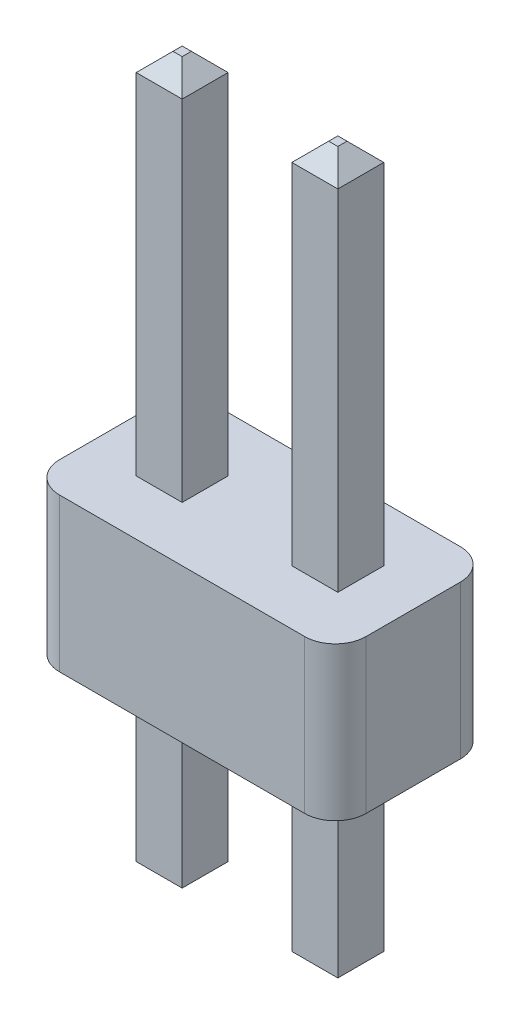
ISO-10303-21;
HEADER;
FILE_DESCRIPTION(('STEP AP214'),'2;1');
FILE_NAME('part.step','',(''),(''),'','','');
FILE_SCHEMA(('AUTOMOTIVE_DESIGN { 1 0 10303 214 1 1 1 1 }'));
ENDSEC;
DATA;
#1=APPLICATION_CONTEXT('core data for automotive mechanical design processes');
#2=APPLICATION_PROTOCOL_DEFINITION('international standard','automotive_design',2000,#1);
#3=PRODUCT_CONTEXT('',#1,'mechanical');
#4=PRODUCT('Part','Part','',(#3));
#5=PRODUCT_RELATED_PRODUCT_CATEGORY('part','',(#4));
#6=PRODUCT_DEFINITION_FORMATION('','',#4);
#7=PRODUCT_DEFINITION_CONTEXT('part definition',#1,'design');
#8=PRODUCT_DEFINITION('design','',#6,#7);
#9=PRODUCT_DEFINITION_SHAPE('','',#8);
#10=(LENGTH_UNIT() NAMED_UNIT(*) SI_UNIT(.MILLI.,.METRE.));
#11=(NAMED_UNIT(*) PLANE_ANGLE_UNIT() SI_UNIT($,.RADIAN.));
#12=(NAMED_UNIT(*) SI_UNIT($,.STERADIAN.) SOLID_ANGLE_UNIT());
#13=UNCERTAINTY_MEASURE_WITH_UNIT(LENGTH_MEASURE(1.E-05),#10,'distance_accuracy_value','');
#14=(GEOMETRIC_REPRESENTATION_CONTEXT(3) GLOBAL_UNCERTAINTY_ASSIGNED_CONTEXT((#13)) GLOBAL_UNIT_ASSIGNED_CONTEXT((#10,
#11,#12)) REPRESENTATION_CONTEXT('',''));
#15=CARTESIAN_POINT('',(0.,0.,0.));
#16=DIRECTION('',(0.,0.,1.));
#17=DIRECTION('',(1.,0.,0.));
#18=AXIS2_PLACEMENT_3D('',#15,#16,#17);
#19=CARTESIAN_POINT('',(2.,2.5,0.77));
#20=DIRECTION('',(0.,-1.,0.));
#21=DIRECTION('',(0.,0.,-1.));
#22=AXIS2_PLACEMENT_3D('',#19,#20,#21);
#23=CYLINDRICAL_SURFACE('',#22,0.5);
#24=CARTESIAN_POINT('',(2.,0.,0.77));
#25=DIRECTION('',(0.,1.,0.));
#26=DIRECTION('',(0.,0.,1.));
#27=AXIS2_PLACEMENT_3D('',#24,#25,#26);
#28=CIRCLE('',#27,0.5);
#29=CARTESIAN_POINT('',(2.,0.,1.27));
#30=VERTEX_POINT('',#29);
#31=CARTESIAN_POINT('',(2.5,0.,0.77));
#32=VERTEX_POINT('',#31);
#33=EDGE_CURVE('E389',#30,#32,#28,.T.);
#34=ORIENTED_EDGE('',*,*,#33,.T.);
#35=DIRECTION('',(0.,-1.,0.));
#36=VECTOR('',#35,1.);
#37=CARTESIAN_POINT('',(2.5,2.5,0.77));
#38=LINE('',#37,#36);
#39=CARTESIAN_POINT('',(2.5,2.5,0.77));
#40=VERTEX_POINT('',#39);
#41=EDGE_CURVE('E466',#40,#32,#38,.T.);
#42=ORIENTED_EDGE('',*,*,#41,.F.);
#43=CARTESIAN_POINT('',(2.,2.5,0.77));
#44=DIRECTION('',(0.,1.,0.));
#45=DIRECTION('',(0.,0.,1.));
#46=AXIS2_PLACEMENT_3D('',#43,#44,#45);
#47=CIRCLE('',#46,0.5);
#48=CARTESIAN_POINT('',(2.,2.5,1.27));
#49=VERTEX_POINT('',#48);
#50=EDGE_CURVE('E390',#49,#40,#47,.T.);
#51=ORIENTED_EDGE('',*,*,#50,.F.);
#52=DIRECTION('',(0.,-1.,0.));
#53=VECTOR('',#52,1.);
#54=CARTESIAN_POINT('',(2.,2.5,1.27));
#55=LINE('',#54,#53);
#56=EDGE_CURVE('E415',#49,#30,#55,.T.);
#57=ORIENTED_EDGE('',*,*,#56,.T.);
#58=EDGE_LOOP('',(#34,#42,#51,#57));
#59=FACE_BOUND('',#58,.T.);
#60=ADVANCED_FACE('F42',(#59),#23,.T.);
#61=CARTESIAN_POINT('',(2.5,2.5,-0.77));
#62=DIRECTION('',(-1.,0.,0.));
#63=DIRECTION('',(0.,0.,1.));
#64=AXIS2_PLACEMENT_3D('',#61,#62,#63);
#65=PLANE('',#64);
#66=DIRECTION('',(0.,0.,-1.));
#67=VECTOR('',#66,1.);
#68=CARTESIAN_POINT('',(2.5,0.,-0.77));
#69=LINE('',#68,#67);
#70=CARTESIAN_POINT('',(2.5,0.,-0.77));
#71=VERTEX_POINT('',#70);
#72=EDGE_CURVE('E419',#32,#71,#69,.T.);
#73=ORIENTED_EDGE('',*,*,#72,.T.);
#74=DIRECTION('',(0.,-1.,0.));
#75=VECTOR('',#74,1.);
#76=CARTESIAN_POINT('',(2.5,2.5,-0.77));
#77=LINE('',#76,#75);
#78=CARTESIAN_POINT('',(2.5,2.5,-0.77));
#79=VERTEX_POINT('',#78);
#80=EDGE_CURVE('E462',#79,#71,#77,.T.);
#81=ORIENTED_EDGE('',*,*,#80,.F.);
#82=DIRECTION('',(0.,0.,-1.));
#83=VECTOR('',#82,1.);
#84=CARTESIAN_POINT('',(2.5,2.5,-0.77));
#85=LINE('',#84,#83);
#86=EDGE_CURVE('E394',#40,#79,#85,.T.);
#87=ORIENTED_EDGE('',*,*,#86,.F.);
#88=ORIENTED_EDGE('',*,*,#41,.T.);
#89=EDGE_LOOP('',(#73,#81,#87,#88));
#90=FACE_BOUND('',#89,.T.);
#91=ADVANCED_FACE('F689',(#90),#65,.F.);
#92=CARTESIAN_POINT('',(2.,2.5,-0.77));
#93=DIRECTION('',(0.,-1.,0.));
#94=DIRECTION('',(0.,0.,-1.));
#95=AXIS2_PLACEMENT_3D('',#92,#93,#94);
#96=CYLINDRICAL_SURFACE('',#95,0.5);
#97=CARTESIAN_POINT('',(2.,0.,-0.77));
#98=DIRECTION('',(0.,1.,0.));
#99=DIRECTION('',(0.,0.,1.));
#100=AXIS2_PLACEMENT_3D('',#97,#98,#99);
#101=CIRCLE('',#100,0.5);
#102=CARTESIAN_POINT('',(2.,0.,-1.27));
#103=VERTEX_POINT('',#102);
#104=EDGE_CURVE('E422',#71,#103,#101,.T.);
#105=ORIENTED_EDGE('',*,*,#104,.T.);
#106=DIRECTION('',(0.,-1.,0.));
#107=VECTOR('',#106,1.);
#108=CARTESIAN_POINT('',(2.,2.5,-1.27));
#109=LINE('',#108,#107);
#110=CARTESIAN_POINT('',(2.,2.5,-1.27));
#111=VERTEX_POINT('',#110);
#112=EDGE_CURVE('E458',#111,#103,#109,.T.);
#113=ORIENTED_EDGE('',*,*,#112,.F.);
#114=CARTESIAN_POINT('',(2.,2.5,-0.77));
#115=DIRECTION('',(0.,1.,0.));
#116=DIRECTION('',(0.,0.,1.));
#117=AXIS2_PLACEMENT_3D('',#114,#115,#116);
#118=CIRCLE('',#117,0.5);
#119=EDGE_CURVE('E397',#79,#111,#118,.T.);
#120=ORIENTED_EDGE('',*,*,#119,.F.);
#121=ORIENTED_EDGE('',*,*,#80,.T.);
#122=EDGE_LOOP('',(#105,#113,#120,#121));
#123=FACE_BOUND('',#122,.T.);
#124=ADVANCED_FACE('F695',(#123),#96,.T.);
#125=CARTESIAN_POINT('',(-2.,2.5,-1.27));
#126=DIRECTION('',(0.,0.,1.));
#127=DIRECTION('',(1.,0.,0.));
#128=AXIS2_PLACEMENT_3D('',#125,#126,#127);
#129=PLANE('',#128);
#130=DIRECTION('',(-1.,0.,0.));
#131=VECTOR('',#130,1.);
#132=CARTESIAN_POINT('',(-2.,0.,-1.27));
#133=LINE('',#132,#131);
#134=CARTESIAN_POINT('',(-2.,0.,-1.27));
#135=VERTEX_POINT('',#134);
#136=EDGE_CURVE('E425',#103,#135,#133,.T.);
#137=ORIENTED_EDGE('',*,*,#136,.T.);
#138=DIRECTION('',(0.,-1.,0.));
#139=VECTOR('',#138,1.);
#140=CARTESIAN_POINT('',(-2.,2.5,-1.27));
#141=LINE('',#140,#139);
#142=CARTESIAN_POINT('',(-2.,2.5,-1.27));
#143=VERTEX_POINT('',#142);
#144=EDGE_CURVE('E454',#143,#135,#141,.T.);
#145=ORIENTED_EDGE('',*,*,#144,.F.);
#146=DIRECTION('',(-1.,0.,0.));
#147=VECTOR('',#146,1.);
#148=CARTESIAN_POINT('',(-2.,2.5,-1.27));
#149=LINE('',#148,#147);
#150=EDGE_CURVE('E400',#111,#143,#149,.T.);
#151=ORIENTED_EDGE('',*,*,#150,.F.);
#152=ORIENTED_EDGE('',*,*,#112,.T.);
#153=EDGE_LOOP('',(#137,#145,#151,#152));
#154=FACE_BOUND('',#153,.T.);
#155=ADVANCED_FACE('F1042',(#154),#129,.F.);
#156=CARTESIAN_POINT('',(-2.,2.5,-0.77));
#157=DIRECTION('',(0.,-1.,0.));
#158=DIRECTION('',(0.,0.,-1.));
#159=AXIS2_PLACEMENT_3D('',#156,#157,#158);
#160=CYLINDRICAL_SURFACE('',#159,0.5);
#161=CARTESIAN_POINT('',(-2.,0.,-0.77));
#162=DIRECTION('',(0.,1.,0.));
#163=DIRECTION('',(0.,0.,1.));
#164=AXIS2_PLACEMENT_3D('',#161,#162,#163);
#165=CIRCLE('',#164,0.5);
#166=CARTESIAN_POINT('',(-2.5,0.,-0.77));
#167=VERTEX_POINT('',#166);
#168=EDGE_CURVE('E428',#135,#167,#165,.T.);
#169=ORIENTED_EDGE('',*,*,#168,.T.);
#170=DIRECTION('',(0.,-1.,0.));
#171=VECTOR('',#170,1.);
#172=CARTESIAN_POINT('',(-2.5,2.5,-0.77));
#173=LINE('',#172,#171);
#174=CARTESIAN_POINT('',(-2.5,2.5,-0.77));
#175=VERTEX_POINT('',#174);
#176=EDGE_CURVE('E450',#175,#167,#173,.T.);
#177=ORIENTED_EDGE('',*,*,#176,.F.);
#178=CARTESIAN_POINT('',(-2.,2.5,-0.77));
#179=DIRECTION('',(0.,1.,0.));
#180=DIRECTION('',(0.,0.,1.));
#181=AXIS2_PLACEMENT_3D('',#178,#179,#180);
#182=CIRCLE('',#181,0.5);
#183=EDGE_CURVE('E403',#143,#175,#182,.T.);
#184=ORIENTED_EDGE('',*,*,#183,.F.);
#185=ORIENTED_EDGE('',*,*,#144,.T.);
#186=EDGE_LOOP('',(#169,#177,#184,#185));
#187=FACE_BOUND('',#186,.T.);
#188=ADVANCED_FACE('F1030',(#187),#160,.T.);
#189=CARTESIAN_POINT('',(-2.5,2.5,0.77));
#190=DIRECTION('',(1.,0.,0.));
#191=DIRECTION('',(0.,0.,-1.));
#192=AXIS2_PLACEMENT_3D('',#189,#190,#191);
#193=PLANE('',#192);
#194=DIRECTION('',(0.,0.,1.));
#195=VECTOR('',#194,1.);
#196=CARTESIAN_POINT('',(-2.5,0.,0.77));
#197=LINE('',#196,#195);
#198=CARTESIAN_POINT('',(-2.5,0.,0.77));
#199=VERTEX_POINT('',#198);
#200=EDGE_CURVE('E431',#167,#199,#197,.T.);
#201=ORIENTED_EDGE('',*,*,#200,.T.);
#202=DIRECTION('',(0.,-1.,0.));
#203=VECTOR('',#202,1.);
#204=CARTESIAN_POINT('',(-2.5,2.5,0.77));
#205=LINE('',#204,#203);
#206=CARTESIAN_POINT('',(-2.5,2.5,0.77));
#207=VERTEX_POINT('',#206);
#208=EDGE_CURVE('E446',#207,#199,#205,.T.);
#209=ORIENTED_EDGE('',*,*,#208,.F.);
#210=DIRECTION('',(0.,0.,1.));
#211=VECTOR('',#210,1.);
#212=CARTESIAN_POINT('',(-2.5,2.5,0.77));
#213=LINE('',#212,#211);
#214=EDGE_CURVE('E406',#175,#207,#213,.T.);
#215=ORIENTED_EDGE('',*,*,#214,.F.);
#216=ORIENTED_EDGE('',*,*,#176,.T.);
#217=EDGE_LOOP('',(#201,#209,#215,#216));
#218=FACE_BOUND('',#217,.T.);
#219=ADVANCED_FACE('F1019',(#218),#193,.F.);
#220=CARTESIAN_POINT('',(-2.,2.5,0.77));
#221=DIRECTION('',(0.,-1.,0.));
#222=DIRECTION('',(0.,0.,-1.));
#223=AXIS2_PLACEMENT_3D('',#220,#221,#222);
#224=CYLINDRICAL_SURFACE('',#223,0.5);
#225=CARTESIAN_POINT('',(-2.,0.,0.77));
#226=DIRECTION('',(0.,1.,0.));
#227=DIRECTION('',(0.,0.,1.));
#228=AXIS2_PLACEMENT_3D('',#225,#226,#227);
#229=CIRCLE('',#228,0.5);
#230=CARTESIAN_POINT('',(-2.,0.,1.27));
#231=VERTEX_POINT('',#230);
#232=EDGE_CURVE('E434',#199,#231,#229,.T.);
#233=ORIENTED_EDGE('',*,*,#232,.T.);
#234=DIRECTION('',(0.,-1.,0.));
#235=VECTOR('',#234,1.);
#236=CARTESIAN_POINT('',(-2.,2.5,1.27));
#237=LINE('',#236,#235);
#238=CARTESIAN_POINT('',(-2.,2.5,1.27));
#239=VERTEX_POINT('',#238);
#240=EDGE_CURVE('E442',#239,#231,#237,.T.);
#241=ORIENTED_EDGE('',*,*,#240,.F.);
#242=CARTESIAN_POINT('',(-2.,2.5,0.77));
#243=DIRECTION('',(0.,1.,0.));
#244=DIRECTION('',(0.,0.,1.));
#245=AXIS2_PLACEMENT_3D('',#242,#243,#244);
#246=CIRCLE('',#245,0.5);
#247=EDGE_CURVE('E409',#207,#239,#246,.T.);
#248=ORIENTED_EDGE('',*,*,#247,.F.);
#249=ORIENTED_EDGE('',*,*,#208,.T.);
#250=EDGE_LOOP('',(#233,#241,#248,#249));
#251=FACE_BOUND('',#250,.T.);
#252=ADVANCED_FACE('F1007',(#251),#224,.T.);
#253=CARTESIAN_POINT('',(2.,2.5,1.27));
#254=DIRECTION('',(0.,0.,-1.));
#255=DIRECTION('',(-1.,0.,0.));
#256=AXIS2_PLACEMENT_3D('',#253,#254,#255);
#257=PLANE('',#256);
#258=DIRECTION('',(1.,0.,0.));
#259=VECTOR('',#258,1.);
#260=CARTESIAN_POINT('',(2.,0.,1.27));
#261=LINE('',#260,#259);
#262=EDGE_CURVE('E395',#231,#30,#261,.T.);
#263=ORIENTED_EDGE('',*,*,#262,.T.);
#264=ORIENTED_EDGE('',*,*,#56,.F.);
#265=DIRECTION('',(1.,0.,0.));
#266=VECTOR('',#265,1.);
#267=CARTESIAN_POINT('',(2.,2.5,1.27));
#268=LINE('',#267,#266);
#269=EDGE_CURVE('E412',#239,#49,#268,.T.);
#270=ORIENTED_EDGE('',*,*,#269,.F.);
#271=ORIENTED_EDGE('',*,*,#240,.T.);
#272=EDGE_LOOP('',(#263,#264,#270,#271));
#273=FACE_BOUND('',#272,.T.);
#274=ADVANCED_FACE('F997',(#273),#257,.F.);
#275=CARTESIAN_POINT('',(2.,2.5,0.77));
#276=DIRECTION('',(0.,1.,0.));
#277=DIRECTION('',(0.,0.,1.));
#278=AXIS2_PLACEMENT_3D('',#275,#276,#277);
#279=PLANE('',#278);
#280=DIRECTION('',(0.,0.,1.));
#281=VECTOR('',#280,1.);
#282=CARTESIAN_POINT('',(0.895,2.5,0.77));
#283=LINE('',#282,#281);
#284=CARTESIAN_POINT('',(0.895,2.5,-0.375));
#285=VERTEX_POINT('',#284);
#286=CARTESIAN_POINT('',(0.895,2.5,0.375));
#287=VERTEX_POINT('',#286);
#288=EDGE_CURVE('E354',#285,#287,#283,.T.);
#289=ORIENTED_EDGE('',*,*,#288,.F.);
#290=DIRECTION('',(-1.,0.,0.));
#291=VECTOR('',#290,1.);
#292=CARTESIAN_POINT('',(2.,2.5,-0.375));
#293=LINE('',#292,#291);
#294=CARTESIAN_POINT('',(1.645,2.5,-0.375));
#295=VERTEX_POINT('',#294);
#296=EDGE_CURVE('E325',#295,#285,#293,.T.);
#297=ORIENTED_EDGE('',*,*,#296,.F.);
#298=DIRECTION('',(0.,0.,-1.));
#299=VECTOR('',#298,1.);
#300=CARTESIAN_POINT('',(1.645,2.5,0.77));
#301=LINE('',#300,#299);
#302=CARTESIAN_POINT('',(1.645,2.5,0.375));
#303=VERTEX_POINT('',#302);
#304=EDGE_CURVE('E318',#303,#295,#301,.T.);
#305=ORIENTED_EDGE('',*,*,#304,.F.);
#306=DIRECTION('',(1.,0.,0.));
#307=VECTOR('',#306,1.);
#308=CARTESIAN_POINT('',(2.,2.5,0.375));
#309=LINE('',#308,#307);
#310=EDGE_CURVE('E322',#287,#303,#309,.T.);
#311=ORIENTED_EDGE('',*,*,#310,.F.);
#312=EDGE_LOOP('',(#289,#297,#305,#311));
#313=FACE_BOUND('',#312,.T.);
#314=DIRECTION('',(0.,0.,-1.));
#315=VECTOR('',#314,1.);
#316=CARTESIAN_POINT('',(-0.895,2.5,0.77));
#317=LINE('',#316,#315);
#318=CARTESIAN_POINT('',(-0.895,2.5,0.375));
#319=VERTEX_POINT('',#318);
#320=CARTESIAN_POINT('',(-0.895,2.5,-0.375));
#321=VERTEX_POINT('',#320);
#322=EDGE_CURVE('E385',#319,#321,#317,.T.);
#323=ORIENTED_EDGE('',*,*,#322,.F.);
#324=DIRECTION('',(1.,0.,0.));
#325=VECTOR('',#324,1.);
#326=CARTESIAN_POINT('',(2.,2.5,0.375));
#327=LINE('',#326,#325);
#328=CARTESIAN_POINT('',(-1.645,2.5,0.375));
#329=VERTEX_POINT('',#328);
#330=EDGE_CURVE('E381',#329,#319,#327,.T.);
#331=ORIENTED_EDGE('',*,*,#330,.F.);
#332=DIRECTION('',(0.,0.,1.));
#333=VECTOR('',#332,1.);
#334=CARTESIAN_POINT('',(-1.645,2.5,0.77));
#335=LINE('',#334,#333);
#336=CARTESIAN_POINT('',(-1.645,2.5,-0.375));
#337=VERTEX_POINT('',#336);
#338=EDGE_CURVE('E377',#337,#329,#335,.T.);
#339=ORIENTED_EDGE('',*,*,#338,.F.);
#340=DIRECTION('',(-1.,0.,0.));
#341=VECTOR('',#340,1.);
#342=CARTESIAN_POINT('',(2.,2.5,-0.375));
#343=LINE('',#342,#341);
#344=EDGE_CURVE('E361',#321,#337,#343,.T.);
#345=ORIENTED_EDGE('',*,*,#344,.F.);
#346=EDGE_LOOP('',(#323,#331,#339,#345));
#347=FACE_BOUND('',#346,.T.);
#348=ORIENTED_EDGE('',*,*,#50,.T.);
#349=ORIENTED_EDGE('',*,*,#86,.T.);
#350=ORIENTED_EDGE('',*,*,#119,.T.);
#351=ORIENTED_EDGE('',*,*,#150,.T.);
#352=ORIENTED_EDGE('',*,*,#183,.T.);
#353=ORIENTED_EDGE('',*,*,#214,.T.);
#354=ORIENTED_EDGE('',*,*,#247,.T.);
#355=ORIENTED_EDGE('',*,*,#269,.T.);
#356=EDGE_LOOP('',(#348,#349,#350,#351,#352,#353,#354,#355));
#357=FACE_BOUND('',#356,.T.);
#358=ADVANCED_FACE('F320',(#313,#347,#357),#279,.T.);
#359=CARTESIAN_POINT('',(2.,0.,0.77));
#360=DIRECTION('',(0.,1.,0.));
#361=DIRECTION('',(0.,0.,1.));
#362=AXIS2_PLACEMENT_3D('',#359,#360,#361);
#363=PLANE('',#362);
#364=DIRECTION('',(-1.,0.,0.));
#365=VECTOR('',#364,1.);
#366=CARTESIAN_POINT('',(2.,0.,-0.375));
#367=LINE('',#366,#365);
#368=CARTESIAN_POINT('',(1.645,0.,-0.375));
#369=VERTEX_POINT('',#368);
#370=CARTESIAN_POINT('',(0.895,0.,-0.375));
#371=VERTEX_POINT('',#370);
#372=EDGE_CURVE('E494',#369,#371,#367,.T.);
#373=ORIENTED_EDGE('',*,*,#372,.T.);
#374=DIRECTION('',(0.,0.,1.));
#375=VECTOR('',#374,1.);
#376=CARTESIAN_POINT('',(0.895,0.,0.77));
#377=LINE('',#376,#375);
#378=CARTESIAN_POINT('',(0.895,0.,0.375));
#379=VERTEX_POINT('',#378);
#380=EDGE_CURVE('E498',#371,#379,#377,.T.);
#381=ORIENTED_EDGE('',*,*,#380,.T.);
#382=DIRECTION('',(1.,0.,0.));
#383=VECTOR('',#382,1.);
#384=CARTESIAN_POINT('',(2.,0.,0.375));
#385=LINE('',#384,#383);
#386=CARTESIAN_POINT('',(1.645,0.,0.375));
#387=VERTEX_POINT('',#386);
#388=EDGE_CURVE('E486',#379,#387,#385,.T.);
#389=ORIENTED_EDGE('',*,*,#388,.T.);
#390=DIRECTION('',(0.,0.,-1.));
#391=VECTOR('',#390,1.);
#392=CARTESIAN_POINT('',(1.645,0.,0.77));
#393=LINE('',#392,#391);
#394=EDGE_CURVE('E490',#387,#369,#393,.T.);
#395=ORIENTED_EDGE('',*,*,#394,.T.);
#396=EDGE_LOOP('',(#373,#381,#389,#395));
#397=FACE_BOUND('',#396,.T.);
#398=DIRECTION('',(1.,0.,0.));
#399=VECTOR('',#398,1.);
#400=CARTESIAN_POINT('',(2.,0.,0.375));
#401=LINE('',#400,#399);
#402=CARTESIAN_POINT('',(-1.645,0.,0.375));
#403=VERTEX_POINT('',#402);
#404=CARTESIAN_POINT('',(-0.895,0.,0.375));
#405=VERTEX_POINT('',#404);
#406=EDGE_CURVE('E478',#403,#405,#401,.T.);
#407=ORIENTED_EDGE('',*,*,#406,.T.);
#408=DIRECTION('',(0.,0.,-1.));
#409=VECTOR('',#408,1.);
#410=CARTESIAN_POINT('',(-0.895,0.,0.77));
#411=LINE('',#410,#409);
#412=CARTESIAN_POINT('',(-0.895,0.,-0.375));
#413=VERTEX_POINT('',#412);
#414=EDGE_CURVE('E482',#405,#413,#411,.T.);
#415=ORIENTED_EDGE('',*,*,#414,.T.);
#416=DIRECTION('',(-1.,0.,0.));
#417=VECTOR('',#416,1.);
#418=CARTESIAN_POINT('',(2.,0.,-0.375));
#419=LINE('',#418,#417);
#420=CARTESIAN_POINT('',(-1.645,0.,-0.375));
#421=VERTEX_POINT('',#420);
#422=EDGE_CURVE('E470',#413,#421,#419,.T.);
#423=ORIENTED_EDGE('',*,*,#422,.T.);
#424=DIRECTION('',(0.,0.,1.));
#425=VECTOR('',#424,1.);
#426=CARTESIAN_POINT('',(-1.645,0.,0.77));
#427=LINE('',#426,#425);
#428=EDGE_CURVE('E474',#421,#403,#427,.T.);
#429=ORIENTED_EDGE('',*,*,#428,.T.);
#430=EDGE_LOOP('',(#407,#415,#423,#429));
#431=FACE_BOUND('',#430,.T.);
#432=ORIENTED_EDGE('',*,*,#33,.F.);
#433=ORIENTED_EDGE('',*,*,#262,.F.);
#434=ORIENTED_EDGE('',*,*,#232,.F.);
#435=ORIENTED_EDGE('',*,*,#200,.F.);
#436=ORIENTED_EDGE('',*,*,#168,.F.);
#437=ORIENTED_EDGE('',*,*,#136,.F.);
#438=ORIENTED_EDGE('',*,*,#104,.F.);
#439=ORIENTED_EDGE('',*,*,#72,.F.);
#440=EDGE_LOOP('',(#432,#433,#434,#435,#436,#437,#438,#439));
#441=FACE_BOUND('',#440,.T.);
#442=ADVANCED_FACE('F975',(#397,#431,#441),#363,.F.);
#443=CARTESIAN_POINT('',(0.,-3.25,0.));
#444=DIRECTION('',(0.,-1.,0.));
#445=DIRECTION('',(0.,0.,-1.));
#446=AXIS2_PLACEMENT_3D('',#443,#444,#445);
#447=PLANE('',#446);
#448=DIRECTION('',(0.,0.,1.));
#449=VECTOR('',#448,1.);
#450=CARTESIAN_POINT('',(-1.195,-3.25,0.));
#451=LINE('',#450,#449);
#452=CARTESIAN_POINT('',(-1.195,-3.25,-0.0750000000000004));
#453=VERTEX_POINT('',#452);
#454=CARTESIAN_POINT('',(-1.195,-3.25,0.075));
#455=VERTEX_POINT('',#454);
#456=EDGE_CURVE('E535',#453,#455,#451,.T.);
#457=ORIENTED_EDGE('',*,*,#456,.T.);
#458=DIRECTION('',(-1.,0.,0.));
#459=VECTOR('',#458,1.);
#460=CARTESIAN_POINT('',(0.,-3.25,0.075));
#461=LINE('',#460,#459);
#462=CARTESIAN_POINT('',(-1.345,-3.25,0.075));
#463=VERTEX_POINT('',#462);
#464=EDGE_CURVE('E541',#455,#463,#461,.T.);
#465=ORIENTED_EDGE('',*,*,#464,.T.);
#466=DIRECTION('',(0.,0.,-1.));
#467=VECTOR('',#466,1.);
#468=CARTESIAN_POINT('',(-1.345,-3.25,0.));
#469=LINE('',#468,#467);
#470=CARTESIAN_POINT('',(-1.345,-3.25,-0.0750000000000004));
#471=VERTEX_POINT('',#470);
#472=EDGE_CURVE('E538',#463,#471,#469,.T.);
#473=ORIENTED_EDGE('',*,*,#472,.T.);
#474=DIRECTION('',(1.,0.,0.));
#475=VECTOR('',#474,1.);
#476=CARTESIAN_POINT('',(0.,-3.25,-0.0750000000000004));
#477=LINE('',#476,#475);
#478=EDGE_CURVE('E532',#471,#453,#477,.T.);
#479=ORIENTED_EDGE('',*,*,#478,.T.);
#480=EDGE_LOOP('',(#457,#465,#473,#479));
#481=FACE_BOUND('',#480,.T.);
#482=ADVANCED_FACE('F966',(#481),#447,.T.);
#483=CARTESIAN_POINT('',(-1.645,-3.25,-0.375));
#484=DIRECTION('',(0.,0.,-1.));
#485=DIRECTION('',(-1.,0.,0.));
#486=AXIS2_PLACEMENT_3D('',#483,#484,#485);
#487=PLANE('',#486);
#488=DIRECTION('',(0.,1.,0.));
#489=VECTOR('',#488,1.);
#490=CARTESIAN_POINT('',(-0.895,-3.25,-0.375));
#491=LINE('',#490,#489);
#492=CARTESIAN_POINT('',(-0.895,-2.95,-0.375));
#493=VERTEX_POINT('',#492);
#494=EDGE_CURVE('E371',#493,#413,#491,.T.);
#495=ORIENTED_EDGE('',*,*,#494,.F.);
#496=DIRECTION('',(-1.,0.,0.));
#497=VECTOR('',#496,1.);
#498=CARTESIAN_POINT('',(-1.645,-2.95,-0.375));
#499=LINE('',#498,#497);
#500=CARTESIAN_POINT('',(-1.645,-2.95,-0.375));
#501=VERTEX_POINT('',#500);
#502=EDGE_CURVE('E551',#493,#501,#499,.T.);
#503=ORIENTED_EDGE('',*,*,#502,.T.);
#504=DIRECTION('',(0.,1.,0.));
#505=VECTOR('',#504,1.);
#506=CARTESIAN_POINT('',(-1.645,-3.25,-0.375));
#507=LINE('',#506,#505);
#508=EDGE_CURVE('E367',#501,#421,#507,.T.);
#509=ORIENTED_EDGE('',*,*,#508,.T.);
#510=ORIENTED_EDGE('',*,*,#422,.F.);
#511=EDGE_LOOP('',(#495,#503,#509,#510));
#512=FACE_BOUND('',#511,.T.);
#513=ADVANCED_FACE('F902',(#512),#487,.T.);
#514=CARTESIAN_POINT('',(-1.645,-3.25,0.375));
#515=DIRECTION('',(-1.,0.,0.));
#516=DIRECTION('',(0.,0.,1.));
#517=AXIS2_PLACEMENT_3D('',#514,#515,#516);
#518=PLANE('',#517);
#519=ORIENTED_EDGE('',*,*,#508,.F.);
#520=DIRECTION('',(0.,0.,1.));
#521=VECTOR('',#520,1.);
#522=CARTESIAN_POINT('',(-1.645,-2.95,0.375));
#523=LINE('',#522,#521);
#524=CARTESIAN_POINT('',(-1.645,-2.95,0.375));
#525=VERTEX_POINT('',#524);
#526=EDGE_CURVE('E545',#501,#525,#523,.T.);
#527=ORIENTED_EDGE('',*,*,#526,.T.);
#528=DIRECTION('',(0.,1.,0.));
#529=VECTOR('',#528,1.);
#530=CARTESIAN_POINT('',(-1.645,-3.25,0.375));
#531=LINE('',#530,#529);
#532=EDGE_CURVE('E363',#525,#403,#531,.T.);
#533=ORIENTED_EDGE('',*,*,#532,.T.);
#534=ORIENTED_EDGE('',*,*,#428,.F.);
#535=EDGE_LOOP('',(#519,#527,#533,#534));
#536=FACE_BOUND('',#535,.T.);
#537=ADVANCED_FACE('F913',(#536),#518,.T.);
#538=CARTESIAN_POINT('',(-0.895,-3.25,0.375));
#539=DIRECTION('',(0.,0.,1.));
#540=DIRECTION('',(1.,0.,0.));
#541=AXIS2_PLACEMENT_3D('',#538,#539,#540);
#542=PLANE('',#541);
#543=ORIENTED_EDGE('',*,*,#532,.F.);
#544=DIRECTION('',(1.,0.,0.));
#545=VECTOR('',#544,1.);
#546=CARTESIAN_POINT('',(-0.895,-2.95,0.375));
#547=LINE('',#546,#545);
#548=CARTESIAN_POINT('',(-0.895,-2.95,0.375));
#549=VERTEX_POINT('',#548);
#550=EDGE_CURVE('E528',#525,#549,#547,.T.);
#551=ORIENTED_EDGE('',*,*,#550,.T.);
#552=DIRECTION('',(0.,1.,0.));
#553=VECTOR('',#552,1.);
#554=CARTESIAN_POINT('',(-0.895,-3.25,0.375));
#555=LINE('',#554,#553);
#556=EDGE_CURVE('E358',#549,#405,#555,.T.);
#557=ORIENTED_EDGE('',*,*,#556,.T.);
#558=ORIENTED_EDGE('',*,*,#406,.F.);
#559=EDGE_LOOP('',(#543,#551,#557,#558));
#560=FACE_BOUND('',#559,.T.);
#561=ADVANCED_FACE('F924',(#560),#542,.T.);
#562=CARTESIAN_POINT('',(-0.895,-3.25,-0.375));
#563=DIRECTION('',(1.,0.,0.));
#564=DIRECTION('',(0.,0.,-1.));
#565=AXIS2_PLACEMENT_3D('',#562,#563,#564);
#566=PLANE('',#565);
#567=ORIENTED_EDGE('',*,*,#556,.F.);
#568=DIRECTION('',(0.,0.,-1.));
#569=VECTOR('',#568,1.);
#570=CARTESIAN_POINT('',(-0.895,-2.95,-0.375));
#571=LINE('',#570,#569);
#572=EDGE_CURVE('E548',#549,#493,#571,.T.);
#573=ORIENTED_EDGE('',*,*,#572,.T.);
#574=ORIENTED_EDGE('',*,*,#494,.T.);
#575=ORIENTED_EDGE('',*,*,#414,.F.);
#576=EDGE_LOOP('',(#567,#573,#574,#575));
#577=FACE_BOUND('',#576,.T.);
#578=ADVANCED_FACE('F932',(#577),#566,.T.);
#579=CARTESIAN_POINT('',(-0.895,8.2,-0.375));
#580=VERTEX_POINT('',#579);
#581=EDGE_CURVE('E357',#321,#580,#491,.T.);
#582=ORIENTED_EDGE('',*,*,#581,.T.);
#583=DIRECTION('',(0.,0.,1.));
#584=VECTOR('',#583,1.);
#585=CARTESIAN_POINT('',(-0.895,8.2,0.375));
#586=LINE('',#585,#584);
#587=CARTESIAN_POINT('',(-0.895,8.2,0.375));
#588=VERTEX_POINT('',#587);
#589=EDGE_CURVE('E574',#580,#588,#586,.T.);
#590=ORIENTED_EDGE('',*,*,#589,.T.);
#591=EDGE_CURVE('E362',#319,#588,#555,.T.);
#592=ORIENTED_EDGE('',*,*,#591,.F.);
#593=ORIENTED_EDGE('',*,*,#322,.T.);
#594=EDGE_LOOP('',(#582,#590,#592,#593));
#595=FACE_BOUND('',#594,.T.);
#596=ADVANCED_FACE('F921',(#595),#566,.T.);
#597=ORIENTED_EDGE('',*,*,#591,.T.);
#598=DIRECTION('',(-1.,0.,0.));
#599=VECTOR('',#598,1.);
#600=CARTESIAN_POINT('',(-1.645,8.2,0.375));
#601=LINE('',#600,#599);
#602=CARTESIAN_POINT('',(-1.645,8.2,0.375));
#603=VERTEX_POINT('',#602);
#604=EDGE_CURVE('E577',#588,#603,#601,.T.);
#605=ORIENTED_EDGE('',*,*,#604,.T.);
#606=EDGE_CURVE('E366',#329,#603,#531,.T.);
#607=ORIENTED_EDGE('',*,*,#606,.F.);
#608=ORIENTED_EDGE('',*,*,#330,.T.);
#609=EDGE_LOOP('',(#597,#605,#607,#608));
#610=FACE_BOUND('',#609,.T.);
#611=ADVANCED_FACE('F910',(#610),#542,.T.);
#612=ORIENTED_EDGE('',*,*,#606,.T.);
#613=DIRECTION('',(0.,0.,-1.));
#614=VECTOR('',#613,1.);
#615=CARTESIAN_POINT('',(-1.645,8.2,-0.375));
#616=LINE('',#615,#614);
#617=CARTESIAN_POINT('',(-1.645,8.2,-0.375));
#618=VERTEX_POINT('',#617);
#619=EDGE_CURVE('E567',#603,#618,#616,.T.);
#620=ORIENTED_EDGE('',*,*,#619,.T.);
#621=EDGE_CURVE('E370',#337,#618,#507,.T.);
#622=ORIENTED_EDGE('',*,*,#621,.F.);
#623=ORIENTED_EDGE('',*,*,#338,.T.);
#624=EDGE_LOOP('',(#612,#620,#622,#623));
#625=FACE_BOUND('',#624,.T.);
#626=ADVANCED_FACE('F899',(#625),#518,.T.);
#627=ORIENTED_EDGE('',*,*,#621,.T.);
#628=DIRECTION('',(1.,0.,0.));
#629=VECTOR('',#628,1.);
#630=CARTESIAN_POINT('',(-0.895,8.2,-0.375));
#631=LINE('',#630,#629);
#632=EDGE_CURVE('E571',#618,#580,#631,.T.);
#633=ORIENTED_EDGE('',*,*,#632,.T.);
#634=ORIENTED_EDGE('',*,*,#581,.F.);
#635=ORIENTED_EDGE('',*,*,#344,.T.);
#636=EDGE_LOOP('',(#627,#633,#634,#635));
#637=FACE_BOUND('',#636,.T.);
#638=ADVANCED_FACE('F889',(#637),#487,.T.);
#639=CARTESIAN_POINT('',(0.,8.5,0.));
#640=DIRECTION('',(0.,-1.,0.));
#641=DIRECTION('',(0.,0.,-1.));
#642=AXIS2_PLACEMENT_3D('',#639,#640,#641);
#643=PLANE('',#642);
#644=DIRECTION('',(-1.,0.,0.));
#645=VECTOR('',#644,1.);
#646=CARTESIAN_POINT('',(-1.645,8.5,-0.0750000000000004));
#647=LINE('',#646,#645);
#648=CARTESIAN_POINT('',(-1.195,8.5,-0.0750000000000004));
#649=VERTEX_POINT('',#648);
#650=CARTESIAN_POINT('',(-1.345,8.5,-0.0750000000000004));
#651=VERTEX_POINT('',#650);
#652=EDGE_CURVE('E560',#649,#651,#647,.T.);
#653=ORIENTED_EDGE('',*,*,#652,.T.);
#654=DIRECTION('',(0.,0.,1.));
#655=VECTOR('',#654,1.);
#656=CARTESIAN_POINT('',(-1.345,8.5,0.375));
#657=LINE('',#656,#655);
#658=CARTESIAN_POINT('',(-1.345,8.5,0.075));
#659=VERTEX_POINT('',#658);
#660=EDGE_CURVE('E563',#651,#659,#657,.T.);
#661=ORIENTED_EDGE('',*,*,#660,.T.);
#662=DIRECTION('',(1.,0.,0.));
#663=VECTOR('',#662,1.);
#664=CARTESIAN_POINT('',(-0.895,8.5,0.075));
#665=LINE('',#664,#663);
#666=CARTESIAN_POINT('',(-1.195,8.5,0.075));
#667=VERTEX_POINT('',#666);
#668=EDGE_CURVE('E554',#659,#667,#665,.T.);
#669=ORIENTED_EDGE('',*,*,#668,.T.);
#670=DIRECTION('',(0.,0.,-1.));
#671=VECTOR('',#670,1.);
#672=CARTESIAN_POINT('',(-1.195,8.5,-0.375));
#673=LINE('',#672,#671);
#674=EDGE_CURVE('E557',#667,#649,#673,.T.);
#675=ORIENTED_EDGE('',*,*,#674,.T.);
#676=EDGE_LOOP('',(#653,#661,#669,#675));
#677=FACE_BOUND('',#676,.T.);
#678=ADVANCED_FACE('F880',(#677),#643,.F.);
#679=CARTESIAN_POINT('',(0.,-3.25,0.));
#680=DIRECTION('',(0.,-1.,0.));
#681=DIRECTION('',(0.,0.,-1.));
#682=AXIS2_PLACEMENT_3D('',#679,#680,#681);
#683=PLANE('',#682);
#684=DIRECTION('',(0.,0.,-1.));
#685=VECTOR('',#684,1.);
#686=CARTESIAN_POINT('',(1.195,-3.25,0.));
#687=LINE('',#686,#685);
#688=CARTESIAN_POINT('',(1.195,-3.25,0.0750000000000002));
#689=VERTEX_POINT('',#688);
#690=CARTESIAN_POINT('',(1.195,-3.25,-0.0750000000000004));
#691=VERTEX_POINT('',#690);
#692=EDGE_CURVE('E509',#689,#691,#687,.T.);
#693=ORIENTED_EDGE('',*,*,#692,.T.);
#694=DIRECTION('',(1.,0.,0.));
#695=VECTOR('',#694,1.);
#696=CARTESIAN_POINT('',(0.,-3.25,-0.0750000000000004));
#697=LINE('',#696,#695);
#698=CARTESIAN_POINT('',(1.345,-3.25,-0.0750000000000004));
#699=VERTEX_POINT('',#698);
#700=EDGE_CURVE('E515',#691,#699,#697,.T.);
#701=ORIENTED_EDGE('',*,*,#700,.T.);
#702=DIRECTION('',(0.,0.,1.));
#703=VECTOR('',#702,1.);
#704=CARTESIAN_POINT('',(1.345,-3.25,0.));
#705=LINE('',#704,#703);
#706=CARTESIAN_POINT('',(1.345,-3.25,0.0750000000000002));
#707=VERTEX_POINT('',#706);
#708=EDGE_CURVE('E512',#699,#707,#705,.T.);
#709=ORIENTED_EDGE('',*,*,#708,.T.);
#710=DIRECTION('',(-1.,0.,0.));
#711=VECTOR('',#710,1.);
#712=CARTESIAN_POINT('',(0.,-3.25,0.0750000000000002));
#713=LINE('',#712,#711);
#714=EDGE_CURVE('E506',#707,#689,#713,.T.);
#715=ORIENTED_EDGE('',*,*,#714,.T.);
#716=EDGE_LOOP('',(#693,#701,#709,#715));
#717=FACE_BOUND('',#716,.T.);
#718=ADVANCED_FACE('F871',(#717),#683,.T.);
#719=CARTESIAN_POINT('',(1.645,-3.25,0.375));
#720=DIRECTION('',(0.,0.,1.));
#721=DIRECTION('',(1.,0.,0.));
#722=AXIS2_PLACEMENT_3D('',#719,#720,#721);
#723=PLANE('',#722);
#724=DIRECTION('',(0.,1.,0.));
#725=VECTOR('',#724,1.);
#726=CARTESIAN_POINT('',(0.895,-3.25,0.375));
#727=LINE('',#726,#725);
#728=CARTESIAN_POINT('',(0.895,-2.95,0.375));
#729=VERTEX_POINT('',#728);
#730=EDGE_CURVE('E341',#729,#379,#727,.T.);
#731=ORIENTED_EDGE('',*,*,#730,.F.);
#732=DIRECTION('',(1.,0.,0.));
#733=VECTOR('',#732,1.);
#734=CARTESIAN_POINT('',(1.645,-2.95,0.375));
#735=LINE('',#734,#733);
#736=CARTESIAN_POINT('',(1.645,-2.95,0.375));
#737=VERTEX_POINT('',#736);
#738=EDGE_CURVE('E525',#729,#737,#735,.T.);
#739=ORIENTED_EDGE('',*,*,#738,.T.);
#740=DIRECTION('',(0.,1.,0.));
#741=VECTOR('',#740,1.);
#742=CARTESIAN_POINT('',(1.645,-3.25,0.375));
#743=LINE('',#742,#741);
#744=EDGE_CURVE('E340',#737,#387,#743,.T.);
#745=ORIENTED_EDGE('',*,*,#744,.T.);
#746=ORIENTED_EDGE('',*,*,#388,.F.);
#747=EDGE_LOOP('',(#731,#739,#745,#746));
#748=FACE_BOUND('',#747,.T.);
#749=ADVANCED_FACE('F686',(#748),#723,.T.);
#750=CARTESIAN_POINT('',(1.645,-3.25,-0.375));
#751=DIRECTION('',(1.,0.,0.));
#752=DIRECTION('',(0.,0.,-1.));
#753=AXIS2_PLACEMENT_3D('',#750,#751,#752);
#754=PLANE('',#753);
#755=ORIENTED_EDGE('',*,*,#744,.F.);
#756=DIRECTION('',(0.,0.,-1.));
#757=VECTOR('',#756,1.);
#758=CARTESIAN_POINT('',(1.645,-2.95,-0.375));
#759=LINE('',#758,#757);
#760=CARTESIAN_POINT('',(1.645,-2.95,-0.375));
#761=VERTEX_POINT('',#760);
#762=EDGE_CURVE('E519',#737,#761,#759,.T.);
#763=ORIENTED_EDGE('',*,*,#762,.T.);
#764=DIRECTION('',(0.,1.,0.));
#765=VECTOR('',#764,1.);
#766=CARTESIAN_POINT('',(1.645,-3.25,-0.375));
#767=LINE('',#766,#765);
#768=EDGE_CURVE('E349',#761,#369,#767,.T.);
#769=ORIENTED_EDGE('',*,*,#768,.T.);
#770=ORIENTED_EDGE('',*,*,#394,.F.);
#771=EDGE_LOOP('',(#755,#763,#769,#770));
#772=FACE_BOUND('',#771,.T.);
#773=ADVANCED_FACE('F821',(#772),#754,.T.);
#774=CARTESIAN_POINT('',(0.895,-3.25,-0.375));
#775=DIRECTION('',(0.,0.,-1.));
#776=DIRECTION('',(-1.,0.,0.));
#777=AXIS2_PLACEMENT_3D('',#774,#775,#776);
#778=PLANE('',#777);
#779=ORIENTED_EDGE('',*,*,#768,.F.);
#780=DIRECTION('',(-1.,0.,0.));
#781=VECTOR('',#780,1.);
#782=CARTESIAN_POINT('',(0.895,-2.95,-0.375));
#783=LINE('',#782,#781);
#784=CARTESIAN_POINT('',(0.895,-2.95,-0.375));
#785=VERTEX_POINT('',#784);
#786=EDGE_CURVE('E502',#761,#785,#783,.T.);
#787=ORIENTED_EDGE('',*,*,#786,.T.);
#788=DIRECTION('',(0.,1.,0.));
#789=VECTOR('',#788,1.);
#790=CARTESIAN_POINT('',(0.895,-3.25,-0.375));
#791=LINE('',#790,#789);
#792=EDGE_CURVE('E336',#785,#371,#791,.T.);
#793=ORIENTED_EDGE('',*,*,#792,.T.);
#794=ORIENTED_EDGE('',*,*,#372,.F.);
#795=EDGE_LOOP('',(#779,#787,#793,#794));
#796=FACE_BOUND('',#795,.T.);
#797=ADVANCED_FACE('F830',(#796),#778,.T.);
#798=CARTESIAN_POINT('',(0.895,-3.25,0.375));
#799=DIRECTION('',(-1.,0.,0.));
#800=DIRECTION('',(0.,0.,1.));
#801=AXIS2_PLACEMENT_3D('',#798,#799,#800);
#802=PLANE('',#801);
#803=ORIENTED_EDGE('',*,*,#792,.F.);
#804=DIRECTION('',(0.,0.,1.));
#805=VECTOR('',#804,1.);
#806=CARTESIAN_POINT('',(0.895,-2.95,0.375));
#807=LINE('',#806,#805);
#808=EDGE_CURVE('E522',#785,#729,#807,.T.);
#809=ORIENTED_EDGE('',*,*,#808,.T.);
#810=ORIENTED_EDGE('',*,*,#730,.T.);
#811=ORIENTED_EDGE('',*,*,#380,.F.);
#812=EDGE_LOOP('',(#803,#809,#810,#811));
#813=FACE_BOUND('',#812,.T.);
#814=ADVANCED_FACE('F838',(#813),#802,.T.);
#815=CARTESIAN_POINT('',(0.895,8.2,0.375));
#816=VERTEX_POINT('',#815);
#817=EDGE_CURVE('E334',#287,#816,#727,.T.);
#818=ORIENTED_EDGE('',*,*,#817,.T.);
#819=DIRECTION('',(0.,0.,-1.));
#820=VECTOR('',#819,1.);
#821=CARTESIAN_POINT('',(0.895,8.2,-0.375));
#822=LINE('',#821,#820);
#823=CARTESIAN_POINT('',(0.895,8.2,-0.375));
#824=VERTEX_POINT('',#823);
#825=EDGE_CURVE('E593',#816,#824,#822,.T.);
#826=ORIENTED_EDGE('',*,*,#825,.T.);
#827=EDGE_CURVE('E1142',#285,#824,#791,.T.);
#828=ORIENTED_EDGE('',*,*,#827,.F.);
#829=ORIENTED_EDGE('',*,*,#288,.T.);
#830=EDGE_LOOP('',(#818,#826,#828,#829));
#831=FACE_BOUND('',#830,.T.);
#832=ADVANCED_FACE('F667',(#831),#802,.T.);
#833=ORIENTED_EDGE('',*,*,#827,.T.);
#834=DIRECTION('',(1.,0.,0.));
#835=VECTOR('',#834,1.);
#836=CARTESIAN_POINT('',(1.645,8.2,-0.375));
#837=LINE('',#836,#835);
#838=CARTESIAN_POINT('',(1.645,8.2,-0.375));
#839=VERTEX_POINT('',#838);
#840=EDGE_CURVE('E73',#824,#839,#837,.T.);
#841=ORIENTED_EDGE('',*,*,#840,.T.);
#842=EDGE_CURVE('E345',#295,#839,#767,.T.);
#843=ORIENTED_EDGE('',*,*,#842,.F.);
#844=ORIENTED_EDGE('',*,*,#296,.T.);
#845=EDGE_LOOP('',(#833,#841,#843,#844));
#846=FACE_BOUND('',#845,.T.);
#847=ADVANCED_FACE('F819',(#846),#778,.T.);
#848=ORIENTED_EDGE('',*,*,#842,.T.);
#849=DIRECTION('',(0.,0.,1.));
#850=VECTOR('',#849,1.);
#851=CARTESIAN_POINT('',(1.645,8.2,0.375));
#852=LINE('',#851,#850);
#853=CARTESIAN_POINT('',(1.645,8.2,0.375));
#854=VERTEX_POINT('',#853);
#855=EDGE_CURVE('E52',#839,#854,#852,.T.);
#856=ORIENTED_EDGE('',*,*,#855,.T.);
#857=EDGE_CURVE('E331',#303,#854,#743,.T.);
#858=ORIENTED_EDGE('',*,*,#857,.F.);
#859=ORIENTED_EDGE('',*,*,#304,.T.);
#860=EDGE_LOOP('',(#848,#856,#858,#859));
#861=FACE_BOUND('',#860,.T.);
#862=ADVANCED_FACE('F338',(#861),#754,.T.);
#863=ORIENTED_EDGE('',*,*,#857,.T.);
#864=DIRECTION('',(-1.,0.,0.));
#865=VECTOR('',#864,1.);
#866=CARTESIAN_POINT('',(0.895,8.2,0.375));
#867=LINE('',#866,#865);
#868=EDGE_CURVE('E11',#854,#816,#867,.T.);
#869=ORIENTED_EDGE('',*,*,#868,.T.);
#870=ORIENTED_EDGE('',*,*,#817,.F.);
#871=ORIENTED_EDGE('',*,*,#310,.T.);
#872=EDGE_LOOP('',(#863,#869,#870,#871));
#873=FACE_BOUND('',#872,.T.);
#874=ADVANCED_FACE('F330',(#873),#723,.T.);
#875=CARTESIAN_POINT('',(0.,8.5,0.));
#876=DIRECTION('',(0.,-1.,0.));
#877=DIRECTION('',(0.,0.,-1.));
#878=AXIS2_PLACEMENT_3D('',#875,#876,#877);
#879=PLANE('',#878);
#880=DIRECTION('',(-1.,0.,0.));
#881=VECTOR('',#880,1.);
#882=CARTESIAN_POINT('',(0.895,8.5,-0.0750000000000004));
#883=LINE('',#882,#881);
#884=CARTESIAN_POINT('',(1.345,8.5,-0.0750000000000004));
#885=VERTEX_POINT('',#884);
#886=CARTESIAN_POINT('',(1.195,8.5,-0.0750000000000004));
#887=VERTEX_POINT('',#886);
#888=EDGE_CURVE('E586',#885,#887,#883,.T.);
#889=ORIENTED_EDGE('',*,*,#888,.T.);
#890=DIRECTION('',(0.,0.,1.));
#891=VECTOR('',#890,1.);
#892=CARTESIAN_POINT('',(1.195,8.5,0.375));
#893=LINE('',#892,#891);
#894=CARTESIAN_POINT('',(1.195,8.5,0.0750000000000001));
#895=VERTEX_POINT('',#894);
#896=EDGE_CURVE('E589',#887,#895,#893,.T.);
#897=ORIENTED_EDGE('',*,*,#896,.T.);
#898=DIRECTION('',(1.,0.,0.));
#899=VECTOR('',#898,1.);
#900=CARTESIAN_POINT('',(1.645,8.5,0.0750000000000001));
#901=LINE('',#900,#899);
#902=CARTESIAN_POINT('',(1.345,8.5,0.0750000000000001));
#903=VERTEX_POINT('',#902);
#904=EDGE_CURVE('E580',#895,#903,#901,.T.);
#905=ORIENTED_EDGE('',*,*,#904,.T.);
#906=DIRECTION('',(0.,0.,-1.));
#907=VECTOR('',#906,1.);
#908=CARTESIAN_POINT('',(1.345,8.5,-0.375));
#909=LINE('',#908,#907);
#910=EDGE_CURVE('E583',#903,#885,#909,.T.);
#911=ORIENTED_EDGE('',*,*,#910,.T.);
#912=EDGE_LOOP('',(#889,#897,#905,#911));
#913=FACE_BOUND('',#912,.T.);
#914=ADVANCED_FACE('F674',(#913),#879,.F.);
#915=CARTESIAN_POINT('',(1.645,-2.95,0.375));
#916=DIRECTION('',(0.,0.707106781186543,-0.707106781186552));
#917=DIRECTION('',(1.,0.,0.));
#918=AXIS2_PLACEMENT_3D('',#915,#916,#917);
#919=PLANE('',#918);
#920=DIRECTION('',(0.577350269189624,-0.57735026918963,-0.577350269189623));
#921=VECTOR('',#920,1.);
#922=CARTESIAN_POINT('',(1.145,-3.2,0.125000000000002));
#923=LINE('',#922,#921);
#924=EDGE_CURVE('E608',#689,#729,#923,.F.);
#925=ORIENTED_EDGE('',*,*,#924,.F.);
#926=ORIENTED_EDGE('',*,*,#714,.F.);
#927=DIRECTION('',(0.577350269189624,0.57735026918963,0.577350269189623));
#928=VECTOR('',#927,1.);
#929=CARTESIAN_POINT('',(1.645,-2.95,0.375));
#930=LINE('',#929,#928);
#931=EDGE_CURVE('E612',#737,#707,#930,.F.);
#932=ORIENTED_EDGE('',*,*,#931,.F.);
#933=ORIENTED_EDGE('',*,*,#738,.F.);
#934=EDGE_LOOP('',(#925,#926,#932,#933));
#935=FACE_BOUND('',#934,.T.);
#936=ADVANCED_FACE('F676',(#935),#919,.F.);
#937=CARTESIAN_POINT('',(1.645,-2.95,-0.375));
#938=DIRECTION('',(-0.707106781186552,0.707106781186544,0.));
#939=DIRECTION('',(0.,0.,-1.));
#940=AXIS2_PLACEMENT_3D('',#937,#938,#939);
#941=PLANE('',#940);
#942=ORIENTED_EDGE('',*,*,#931,.T.);
#943=ORIENTED_EDGE('',*,*,#708,.F.);
#944=DIRECTION('',(0.577350269189624,0.57735026918963,-0.577350269189623));
#945=VECTOR('',#944,1.);
#946=CARTESIAN_POINT('',(1.645,-2.95,-0.375));
#947=LINE('',#946,#945);
#948=EDGE_CURVE('E604',#761,#699,#947,.F.);
#949=ORIENTED_EDGE('',*,*,#948,.F.);
#950=ORIENTED_EDGE('',*,*,#762,.F.);
#951=EDGE_LOOP('',(#942,#943,#949,#950));
#952=FACE_BOUND('',#951,.T.);
#953=ADVANCED_FACE('F682',(#952),#941,.F.);
#954=CARTESIAN_POINT('',(0.895,-2.95,0.375));
#955=DIRECTION('',(0.707106781186552,0.707106781186544,0.));
#956=DIRECTION('',(0.,0.,1.));
#957=AXIS2_PLACEMENT_3D('',#954,#955,#956);
#958=PLANE('',#957);
#959=ORIENTED_EDGE('',*,*,#924,.T.);
#960=ORIENTED_EDGE('',*,*,#808,.F.);
#961=DIRECTION('',(0.577350269189624,-0.57735026918963,0.577350269189623));
#962=VECTOR('',#961,1.);
#963=CARTESIAN_POINT('',(1.145,-3.2,-0.125000000000002));
#964=LINE('',#963,#962);
#965=EDGE_CURVE('E601',#691,#785,#964,.F.);
#966=ORIENTED_EDGE('',*,*,#965,.F.);
#967=ORIENTED_EDGE('',*,*,#692,.F.);
#968=EDGE_LOOP('',(#959,#960,#966,#967));
#969=FACE_BOUND('',#968,.T.);
#970=ADVANCED_FACE('F704',(#969),#958,.F.);
#971=CARTESIAN_POINT('',(0.895,-2.95,-0.375));
#972=DIRECTION('',(0.,0.707106781186543,0.707106781186552));
#973=DIRECTION('',(-1.,0.,0.));
#974=AXIS2_PLACEMENT_3D('',#971,#972,#973);
#975=PLANE('',#974);
#976=ORIENTED_EDGE('',*,*,#948,.T.);
#977=ORIENTED_EDGE('',*,*,#700,.F.);
#978=ORIENTED_EDGE('',*,*,#965,.T.);
#979=ORIENTED_EDGE('',*,*,#786,.F.);
#980=EDGE_LOOP('',(#976,#977,#978,#979));
#981=FACE_BOUND('',#980,.T.);
#982=ADVANCED_FACE('F700',(#981),#975,.F.);
#983=CARTESIAN_POINT('',(-1.645,-2.95,-0.375));
#984=DIRECTION('',(0.,0.707106781186543,0.707106781186552));
#985=DIRECTION('',(-1.,0.,0.));
#986=AXIS2_PLACEMENT_3D('',#983,#984,#985);
#987=PLANE('',#986);
#988=DIRECTION('',(-0.577350269189623,-0.577350269189631,0.577350269189623));
#989=VECTOR('',#988,1.);
#990=CARTESIAN_POINT('',(-1.145,-3.2,-0.125000000000002));
#991=LINE('',#990,#989);
#992=EDGE_CURVE('E623',#453,#493,#991,.F.);
#993=ORIENTED_EDGE('',*,*,#992,.F.);
#994=ORIENTED_EDGE('',*,*,#478,.F.);
#995=DIRECTION('',(-0.577350269189624,0.57735026918963,-0.577350269189623));
#996=VECTOR('',#995,1.);
#997=CARTESIAN_POINT('',(-1.645,-2.95,-0.375));
#998=LINE('',#997,#996);
#999=EDGE_CURVE('E605',#501,#471,#998,.F.);
#1000=ORIENTED_EDGE('',*,*,#999,.F.);
#1001=ORIENTED_EDGE('',*,*,#502,.F.);
#1002=EDGE_LOOP('',(#993,#994,#1000,#1001));
#1003=FACE_BOUND('',#1002,.T.);
#1004=ADVANCED_FACE('F703',(#1003),#987,.F.);
#1005=CARTESIAN_POINT('',(-1.645,-2.95,0.375));
#1006=DIRECTION('',(0.707106781186552,0.707106781186544,0.));
#1007=DIRECTION('',(0.,0.,1.));
#1008=AXIS2_PLACEMENT_3D('',#1005,#1006,#1007);
#1009=PLANE('',#1008);
#1010=ORIENTED_EDGE('',*,*,#999,.T.);
#1011=ORIENTED_EDGE('',*,*,#472,.F.);
#1012=DIRECTION('',(-0.577350269189624,0.57735026918963,0.577350269189624));
#1013=VECTOR('',#1012,1.);
#1014=CARTESIAN_POINT('',(-1.645,-2.95,0.375));
#1015=LINE('',#1014,#1013);
#1016=EDGE_CURVE('E619',#525,#463,#1015,.F.);
#1017=ORIENTED_EDGE('',*,*,#1016,.F.);
#1018=ORIENTED_EDGE('',*,*,#526,.F.);
#1019=EDGE_LOOP('',(#1010,#1011,#1017,#1018));
#1020=FACE_BOUND('',#1019,.T.);
#1021=ADVANCED_FACE('F720',(#1020),#1009,.F.);
#1022=CARTESIAN_POINT('',(-0.895,-2.95,-0.375));
#1023=DIRECTION('',(-0.707106781186552,0.707106781186543,0.));
#1024=DIRECTION('',(0.,0.,-1.));
#1025=AXIS2_PLACEMENT_3D('',#1022,#1023,#1024);
#1026=PLANE('',#1025);
#1027=ORIENTED_EDGE('',*,*,#992,.T.);
#1028=ORIENTED_EDGE('',*,*,#572,.F.);
#1029=DIRECTION('',(-0.577350269189623,-0.577350269189631,-0.577350269189624));
#1030=VECTOR('',#1029,1.);
#1031=CARTESIAN_POINT('',(-1.145,-3.2,0.125000000000002));
#1032=LINE('',#1031,#1030);
#1033=EDGE_CURVE('E616',#455,#549,#1032,.F.);
#1034=ORIENTED_EDGE('',*,*,#1033,.F.);
#1035=ORIENTED_EDGE('',*,*,#456,.F.);
#1036=EDGE_LOOP('',(#1027,#1028,#1034,#1035));
#1037=FACE_BOUND('',#1036,.T.);
#1038=ADVANCED_FACE('F716',(#1037),#1026,.F.);
#1039=CARTESIAN_POINT('',(-0.895,-2.95,0.375));
#1040=DIRECTION('',(0.,0.707106781186544,-0.707106781186552));
#1041=DIRECTION('',(1.,0.,0.));
#1042=AXIS2_PLACEMENT_3D('',#1039,#1040,#1041);
#1043=PLANE('',#1042);
#1044=ORIENTED_EDGE('',*,*,#1016,.T.);
#1045=ORIENTED_EDGE('',*,*,#464,.F.);
#1046=ORIENTED_EDGE('',*,*,#1033,.T.);
#1047=ORIENTED_EDGE('',*,*,#550,.F.);
#1048=EDGE_LOOP('',(#1044,#1045,#1046,#1047));
#1049=FACE_BOUND('',#1048,.T.);
#1050=ADVANCED_FACE('F712',(#1049),#1043,.F.);
#1051=CARTESIAN_POINT('',(-1.195,8.5,0.));
#1052=DIRECTION('',(0.707106781186544,0.707106781186551,0.));
#1053=DIRECTION('',(0.,0.,1.));
#1054=AXIS2_PLACEMENT_3D('',#1051,#1052,#1053);
#1055=PLANE('',#1054);
#1056=DIRECTION('',(-0.577350269189628,0.577350269189622,-0.577350269189628));
#1057=VECTOR('',#1056,1.);
#1058=CARTESIAN_POINT('',(-0.796666666666664,8.10166666666667,0.473333333333336));
#1059=LINE('',#1058,#1057);
#1060=EDGE_CURVE('E636',#588,#667,#1059,.T.);
#1061=ORIENTED_EDGE('',*,*,#1060,.F.);
#1062=ORIENTED_EDGE('',*,*,#589,.F.);
#1063=DIRECTION('',(-0.577350269189628,0.577350269189622,0.577350269189628));
#1064=VECTOR('',#1063,1.);
#1065=CARTESIAN_POINT('',(-1.22,8.525,-0.0500000000000001));
#1066=LINE('',#1065,#1064);
#1067=EDGE_CURVE('E620',#649,#580,#1066,.F.);
#1068=ORIENTED_EDGE('',*,*,#1067,.F.);
#1069=ORIENTED_EDGE('',*,*,#674,.F.);
#1070=EDGE_LOOP('',(#1061,#1062,#1068,#1069));
#1071=FACE_BOUND('',#1070,.T.);
#1072=ADVANCED_FACE('F715',(#1071),#1055,.T.);
#1073=CARTESIAN_POINT('',(0.,8.5,-0.0750000000000004));
#1074=DIRECTION('',(0.,0.707106781186551,-0.707106781186544));
#1075=DIRECTION('',(1.,0.,0.));
#1076=AXIS2_PLACEMENT_3D('',#1073,#1074,#1075);
#1077=PLANE('',#1076);
#1078=ORIENTED_EDGE('',*,*,#1067,.T.);
#1079=ORIENTED_EDGE('',*,*,#632,.F.);
#1080=DIRECTION('',(0.577350269189628,0.577350269189622,0.577350269189628));
#1081=VECTOR('',#1080,1.);
#1082=CARTESIAN_POINT('',(-0.896666666666663,8.94833333333333,0.373333333333336));
#1083=LINE('',#1082,#1081);
#1084=EDGE_CURVE('E633',#651,#618,#1083,.F.);
#1085=ORIENTED_EDGE('',*,*,#1084,.F.);
#1086=ORIENTED_EDGE('',*,*,#652,.F.);
#1087=EDGE_LOOP('',(#1078,#1079,#1085,#1086));
#1088=FACE_BOUND('',#1087,.T.);
#1089=ADVANCED_FACE('F735',(#1088),#1077,.T.);
#1090=CARTESIAN_POINT('',(0.,8.5,0.075));
#1091=DIRECTION('',(0.,0.707106781186552,0.707106781186543));
#1092=DIRECTION('',(-1.,0.,0.));
#1093=AXIS2_PLACEMENT_3D('',#1090,#1091,#1092);
#1094=PLANE('',#1093);
#1095=ORIENTED_EDGE('',*,*,#1060,.T.);
#1096=ORIENTED_EDGE('',*,*,#668,.F.);
#1097=DIRECTION('',(-0.577350269189628,-0.577350269189622,0.577350269189628));
#1098=VECTOR('',#1097,1.);
#1099=CARTESIAN_POINT('',(-0.896666666666664,8.94833333333333,-0.373333333333337));
#1100=LINE('',#1099,#1098);
#1101=EDGE_CURVE('E630',#603,#659,#1100,.F.);
#1102=ORIENTED_EDGE('',*,*,#1101,.F.);
#1103=ORIENTED_EDGE('',*,*,#604,.F.);
#1104=EDGE_LOOP('',(#1095,#1096,#1102,#1103));
#1105=FACE_BOUND('',#1104,.T.);
#1106=ADVANCED_FACE('F731',(#1105),#1094,.T.);
#1107=CARTESIAN_POINT('',(-1.345,8.5,0.));
#1108=DIRECTION('',(-0.707106781186543,0.707106781186552,0.));
#1109=DIRECTION('',(0.,0.,-1.));
#1110=AXIS2_PLACEMENT_3D('',#1107,#1108,#1109);
#1111=PLANE('',#1110);
#1112=ORIENTED_EDGE('',*,*,#1084,.T.);
#1113=ORIENTED_EDGE('',*,*,#619,.F.);
#1114=ORIENTED_EDGE('',*,*,#1101,.T.);
#1115=ORIENTED_EDGE('',*,*,#660,.F.);
#1116=EDGE_LOOP('',(#1112,#1113,#1114,#1115));
#1117=FACE_BOUND('',#1116,.T.);
#1118=ADVANCED_FACE('F728',(#1117),#1111,.T.);
#1119=CARTESIAN_POINT('',(1.345,8.5,0.));
#1120=DIRECTION('',(0.707106781186543,0.707106781186552,0.));
#1121=DIRECTION('',(0.,0.,1.));
#1122=AXIS2_PLACEMENT_3D('',#1119,#1120,#1121);
#1123=PLANE('',#1122);
#1124=DIRECTION('',(-0.577350269189628,0.577350269189622,-0.577350269189628));
#1125=VECTOR('',#1124,1.);
#1126=CARTESIAN_POINT('',(0.896666666666663,8.94833333333333,-0.373333333333337));
#1127=LINE('',#1126,#1125);
#1128=EDGE_CURVE('E648',#854,#903,#1127,.T.);
#1129=ORIENTED_EDGE('',*,*,#1128,.F.);
#1130=ORIENTED_EDGE('',*,*,#855,.F.);
#1131=DIRECTION('',(-0.577350269189628,0.577350269189622,0.577350269189628));
#1132=VECTOR('',#1131,1.);
#1133=CARTESIAN_POINT('',(1.32,8.525,-0.0500000000000001));
#1134=LINE('',#1133,#1132);
#1135=EDGE_CURVE('E46',#885,#839,#1134,.F.);
#1136=ORIENTED_EDGE('',*,*,#1135,.F.);
#1137=ORIENTED_EDGE('',*,*,#910,.F.);
#1138=EDGE_LOOP('',(#1129,#1130,#1136,#1137));
#1139=FACE_BOUND('',#1138,.T.);
#1140=ADVANCED_FACE('F44',(#1139),#1123,.T.);
#1141=CARTESIAN_POINT('',(0.,8.5,-0.0750000000000004));
#1142=DIRECTION('',(0.,0.707106781186551,-0.707106781186544));
#1143=DIRECTION('',(1.,0.,0.));
#1144=AXIS2_PLACEMENT_3D('',#1141,#1142,#1143);
#1145=PLANE('',#1144);
#1146=ORIENTED_EDGE('',*,*,#1135,.T.);
#1147=ORIENTED_EDGE('',*,*,#840,.F.);
#1148=DIRECTION('',(0.577350269189628,0.577350269189622,0.577350269189628));
#1149=VECTOR('',#1148,1.);
#1150=CARTESIAN_POINT('',(0.796666666666663,8.10166666666667,-0.473333333333337));
#1151=LINE('',#1150,#1149);
#1152=EDGE_CURVE('E646',#887,#824,#1151,.F.);
#1153=ORIENTED_EDGE('',*,*,#1152,.F.);
#1154=ORIENTED_EDGE('',*,*,#888,.F.);
#1155=EDGE_LOOP('',(#1146,#1147,#1153,#1154));
#1156=FACE_BOUND('',#1155,.T.);
#1157=ADVANCED_FACE('F659',(#1156),#1145,.T.);
#1158=CARTESIAN_POINT('',(0.,8.5,0.0750000000000001));
#1159=DIRECTION('',(0.,0.707106781186551,0.707106781186544));
#1160=DIRECTION('',(-1.,0.,0.));
#1161=AXIS2_PLACEMENT_3D('',#1158,#1159,#1160);
#1162=PLANE('',#1161);
#1163=ORIENTED_EDGE('',*,*,#1128,.T.);
#1164=ORIENTED_EDGE('',*,*,#904,.F.);
#1165=DIRECTION('',(-0.577350269189628,-0.577350269189622,0.577350269189628));
#1166=VECTOR('',#1165,1.);
#1167=CARTESIAN_POINT('',(0.796666666666663,8.10166666666667,0.473333333333336));
#1168=LINE('',#1167,#1166);
#1169=EDGE_CURVE('E643',#816,#895,#1168,.F.);
#1170=ORIENTED_EDGE('',*,*,#1169,.F.);
#1171=ORIENTED_EDGE('',*,*,#868,.F.);
#1172=EDGE_LOOP('',(#1163,#1164,#1170,#1171));
#1173=FACE_BOUND('',#1172,.T.);
#1174=ADVANCED_FACE('F664',(#1173),#1162,.T.);
#1175=CARTESIAN_POINT('',(1.195,8.5,0.));
#1176=DIRECTION('',(-0.707106781186543,0.707106781186552,0.));
#1177=DIRECTION('',(0.,0.,-1.));
#1178=AXIS2_PLACEMENT_3D('',#1175,#1176,#1177);
#1179=PLANE('',#1178);
#1180=ORIENTED_EDGE('',*,*,#1152,.T.);
#1181=ORIENTED_EDGE('',*,*,#825,.F.);
#1182=ORIENTED_EDGE('',*,*,#1169,.T.);
#1183=ORIENTED_EDGE('',*,*,#896,.F.);
#1184=EDGE_LOOP('',(#1180,#1181,#1182,#1183));
#1185=FACE_BOUND('',#1184,.T.);
#1186=ADVANCED_FACE('F671',(#1185),#1179,.T.);
#1187=CLOSED_SHELL('',(#60,#91,#124,#155,#188,#219,#252,#274,#358,#442,#482,#513,#537,#561,#578,
#596,#611,#626,#638,#678,#718,#749,#773,#797,#814,#832,#847,#862,#874,#914,#936,#953,#970,#982,
#1004,#1021,#1038,#1050,#1072,#1089,#1106,#1118,#1140,#1157,#1174,#1186));
#1188=MANIFOLD_SOLID_BREP('B2',#1187);
#1189=ADVANCED_BREP_SHAPE_REPRESENTATION('',(#18,#1188),#14);
#1190=SHAPE_DEFINITION_REPRESENTATION(#9,#1189);
ENDSEC;
END-ISO-10303-21;
